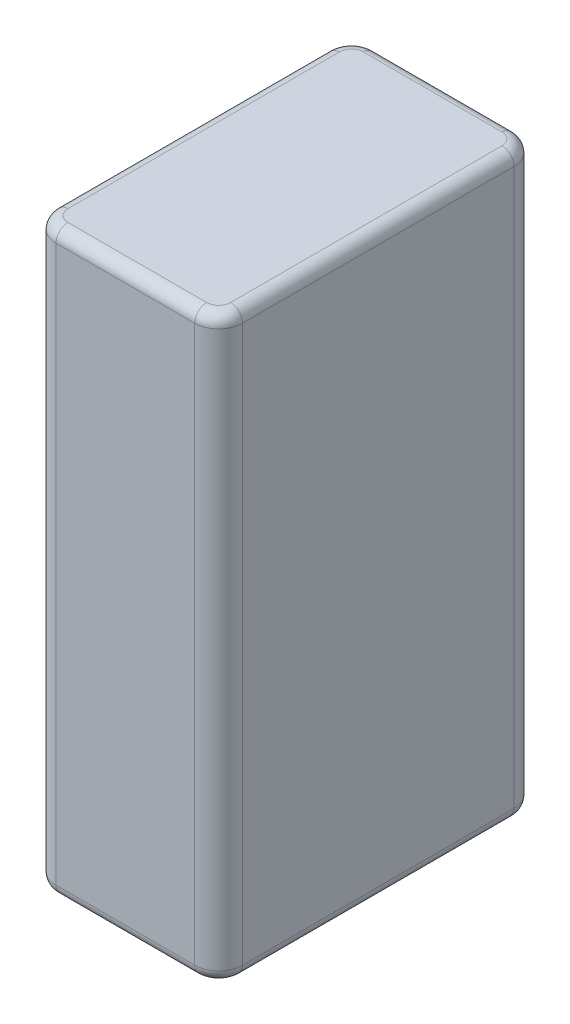
ISO-10303-21;
HEADER;
FILE_DESCRIPTION(('STEP AP214'),'2;1');
FILE_NAME('part.step','',(''),(''),'','','');
FILE_SCHEMA(('AUTOMOTIVE_DESIGN { 1 0 10303 214 1 1 1 1 }'));
ENDSEC;
DATA;
#1=APPLICATION_CONTEXT('core data for automotive mechanical design processes');
#2=APPLICATION_PROTOCOL_DEFINITION('international standard','automotive_design',2000,#1);
#3=PRODUCT_CONTEXT('',#1,'mechanical');
#4=PRODUCT('Part','Part','',(#3));
#5=PRODUCT_RELATED_PRODUCT_CATEGORY('part','',(#4));
#6=PRODUCT_DEFINITION_FORMATION('','',#4);
#7=PRODUCT_DEFINITION_CONTEXT('part definition',#1,'design');
#8=PRODUCT_DEFINITION('design','',#6,#7);
#9=PRODUCT_DEFINITION_SHAPE('','',#8);
#10=(LENGTH_UNIT() NAMED_UNIT(*) SI_UNIT(.MILLI.,.METRE.));
#11=(NAMED_UNIT(*) PLANE_ANGLE_UNIT() SI_UNIT($,.RADIAN.));
#12=(NAMED_UNIT(*) SI_UNIT($,.STERADIAN.) SOLID_ANGLE_UNIT());
#13=UNCERTAINTY_MEASURE_WITH_UNIT(LENGTH_MEASURE(1.E-05),#10,'distance_accuracy_value','');
#14=(GEOMETRIC_REPRESENTATION_CONTEXT(3) GLOBAL_UNCERTAINTY_ASSIGNED_CONTEXT((#13)) GLOBAL_UNIT_ASSIGNED_CONTEXT((#10,
#11,#12)) REPRESENTATION_CONTEXT('',''));
#15=CARTESIAN_POINT('',(0.,0.,0.));
#16=DIRECTION('',(0.,0.,1.));
#17=DIRECTION('',(1.,0.,0.));
#18=AXIS2_PLACEMENT_3D('',#15,#16,#17);
#19=CARTESIAN_POINT('',(-7.8,48.5,-13.35));
#20=DIRECTION('',(1.,0.,0.));
#21=DIRECTION('',(0.,0.,-1.));
#22=AXIS2_PLACEMENT_3D('',#19,#20,#21);
#23=PLANE('',#22);
#24=DIRECTION('',(0.,-1.,0.));
#25=VECTOR('',#24,1.);
#26=CARTESIAN_POINT('',(-7.79999999999999,48.5,11.35));
#27=LINE('',#26,#25);
#28=CARTESIAN_POINT('',(-7.79999999999999,1.,11.35));
#29=VERTEX_POINT('',#28);
#30=CARTESIAN_POINT('',(-7.79999999999999,47.5,11.35));
#31=VERTEX_POINT('',#30);
#32=EDGE_CURVE('E334',#29,#31,#27,.F.);
#33=ORIENTED_EDGE('',*,*,#32,.T.);
#34=DIRECTION('',(0.,0.,1.));
#35=VECTOR('',#34,1.);
#36=CARTESIAN_POINT('',(-7.8,47.5,-11.35));
#37=LINE('',#36,#35);
#38=CARTESIAN_POINT('',(-7.8,47.5,-11.35));
#39=VERTEX_POINT('',#38);
#40=EDGE_CURVE('E11',#31,#39,#37,.F.);
#41=ORIENTED_EDGE('',*,*,#40,.T.);
#42=DIRECTION('',(0.,-1.,0.));
#43=VECTOR('',#42,1.);
#44=CARTESIAN_POINT('',(-7.8,48.5,-11.35));
#45=LINE('',#44,#43);
#46=CARTESIAN_POINT('',(-7.8,1.,-11.35));
#47=VERTEX_POINT('',#46);
#48=EDGE_CURVE('E317',#39,#47,#45,.T.);
#49=ORIENTED_EDGE('',*,*,#48,.T.);
#50=DIRECTION('',(0.,0.,1.));
#51=VECTOR('',#50,1.);
#52=CARTESIAN_POINT('',(-7.8,1.,-13.35));
#53=LINE('',#52,#51);
#54=EDGE_CURVE('E42',#47,#29,#53,.T.);
#55=ORIENTED_EDGE('',*,*,#54,.T.);
#56=EDGE_LOOP('',(#33,#41,#49,#55));
#57=FACE_BOUND('',#56,.T.);
#58=ADVANCED_FACE('F33',(#57),#23,.F.);
#59=CARTESIAN_POINT('',(-7.79999999999999,48.5,13.35));
#60=DIRECTION('',(0.,0.,-1.));
#61=DIRECTION('',(-1.,0.,0.));
#62=AXIS2_PLACEMENT_3D('',#59,#60,#61);
#63=PLANE('',#62);
#64=DIRECTION('',(0.,-1.,0.));
#65=VECTOR('',#64,1.);
#66=CARTESIAN_POINT('',(5.8,48.5,13.35));
#67=LINE('',#66,#65);
#68=CARTESIAN_POINT('',(5.8,1.,13.35));
#69=VERTEX_POINT('',#68);
#70=CARTESIAN_POINT('',(5.8,47.5,13.35));
#71=VERTEX_POINT('',#70);
#72=EDGE_CURVE('E241',#69,#71,#67,.F.);
#73=ORIENTED_EDGE('',*,*,#72,.T.);
#74=DIRECTION('',(1.,0.,0.));
#75=VECTOR('',#74,1.);
#76=CARTESIAN_POINT('',(-5.79999999999999,47.5,13.35));
#77=LINE('',#76,#75);
#78=CARTESIAN_POINT('',(-5.79999999999999,47.5,13.35));
#79=VERTEX_POINT('',#78);
#80=EDGE_CURVE('E202',#71,#79,#77,.F.);
#81=ORIENTED_EDGE('',*,*,#80,.T.);
#82=DIRECTION('',(0.,-1.,0.));
#83=VECTOR('',#82,1.);
#84=CARTESIAN_POINT('',(-5.79999999999999,48.5,13.35));
#85=LINE('',#84,#83);
#86=CARTESIAN_POINT('',(-5.79999999999999,1.,13.35));
#87=VERTEX_POINT('',#86);
#88=EDGE_CURVE('E335',#79,#87,#85,.T.);
#89=ORIENTED_EDGE('',*,*,#88,.T.);
#90=DIRECTION('',(1.,0.,0.));
#91=VECTOR('',#90,1.);
#92=CARTESIAN_POINT('',(-7.79999999999999,1.,13.35));
#93=LINE('',#92,#91);
#94=EDGE_CURVE('E200',#87,#69,#93,.T.);
#95=ORIENTED_EDGE('',*,*,#94,.T.);
#96=EDGE_LOOP('',(#73,#81,#89,#95));
#97=FACE_BOUND('',#96,.T.);
#98=ADVANCED_FACE('F343',(#97),#63,.F.);
#99=CARTESIAN_POINT('',(7.8,48.5,-13.35));
#100=DIRECTION('',(-1.,0.,0.));
#101=DIRECTION('',(0.,0.,1.));
#102=AXIS2_PLACEMENT_3D('',#99,#100,#101);
#103=PLANE('',#102);
#104=DIRECTION('',(0.,-1.,0.));
#105=VECTOR('',#104,1.);
#106=CARTESIAN_POINT('',(7.8,48.5,-11.35));
#107=LINE('',#106,#105);
#108=CARTESIAN_POINT('',(7.8,1.,-11.35));
#109=VERTEX_POINT('',#108);
#110=CARTESIAN_POINT('',(7.8,47.5,-11.35));
#111=VERTEX_POINT('',#110);
#112=EDGE_CURVE('E169',#109,#111,#107,.F.);
#113=ORIENTED_EDGE('',*,*,#112,.T.);
#114=DIRECTION('',(0.,0.,-1.));
#115=VECTOR('',#114,1.);
#116=CARTESIAN_POINT('',(7.8,47.5,11.35));
#117=LINE('',#116,#115);
#118=CARTESIAN_POINT('',(7.8,47.5,11.35));
#119=VERTEX_POINT('',#118);
#120=EDGE_CURVE('E194',#111,#119,#117,.F.);
#121=ORIENTED_EDGE('',*,*,#120,.T.);
#122=DIRECTION('',(0.,-1.,0.));
#123=VECTOR('',#122,1.);
#124=CARTESIAN_POINT('',(7.8,48.5,11.35));
#125=LINE('',#124,#123);
#126=CARTESIAN_POINT('',(7.8,1.,11.35));
#127=VERTEX_POINT('',#126);
#128=EDGE_CURVE('E277',#119,#127,#125,.T.);
#129=ORIENTED_EDGE('',*,*,#128,.T.);
#130=DIRECTION('',(0.,0.,-1.));
#131=VECTOR('',#130,1.);
#132=CARTESIAN_POINT('',(7.8,1.,-13.35));
#133=LINE('',#132,#131);
#134=EDGE_CURVE('E192',#127,#109,#133,.T.);
#135=ORIENTED_EDGE('',*,*,#134,.T.);
#136=EDGE_LOOP('',(#113,#121,#129,#135));
#137=FACE_BOUND('',#136,.T.);
#138=ADVANCED_FACE('F282',(#137),#103,.F.);
#139=CARTESIAN_POINT('',(-7.8,48.5,-13.35));
#140=DIRECTION('',(0.,0.,1.));
#141=DIRECTION('',(1.,0.,0.));
#142=AXIS2_PLACEMENT_3D('',#139,#140,#141);
#143=PLANE('',#142);
#144=DIRECTION('',(0.,-1.,0.));
#145=VECTOR('',#144,1.);
#146=CARTESIAN_POINT('',(-5.8,48.5,-13.35));
#147=LINE('',#146,#145);
#148=CARTESIAN_POINT('',(-5.8,1.,-13.35));
#149=VERTEX_POINT('',#148);
#150=CARTESIAN_POINT('',(-5.8,47.5,-13.35));
#151=VERTEX_POINT('',#150);
#152=EDGE_CURVE('E285',#149,#151,#147,.F.);
#153=ORIENTED_EDGE('',*,*,#152,.T.);
#154=DIRECTION('',(-1.,0.,0.));
#155=VECTOR('',#154,1.);
#156=CARTESIAN_POINT('',(5.8,47.5,-13.35));
#157=LINE('',#156,#155);
#158=CARTESIAN_POINT('',(5.8,47.5,-13.35));
#159=VERTEX_POINT('',#158);
#160=EDGE_CURVE('E186',#151,#159,#157,.F.);
#161=ORIENTED_EDGE('',*,*,#160,.T.);
#162=DIRECTION('',(0.,-1.,0.));
#163=VECTOR('',#162,1.);
#164=CARTESIAN_POINT('',(5.8,48.5,-13.35));
#165=LINE('',#164,#163);
#166=CARTESIAN_POINT('',(5.8,1.,-13.35));
#167=VERTEX_POINT('',#166);
#168=EDGE_CURVE('E289',#159,#167,#165,.T.);
#169=ORIENTED_EDGE('',*,*,#168,.T.);
#170=DIRECTION('',(-1.,0.,0.));
#171=VECTOR('',#170,1.);
#172=CARTESIAN_POINT('',(-7.8,1.,-13.35));
#173=LINE('',#172,#171);
#174=EDGE_CURVE('E184',#167,#149,#173,.T.);
#175=ORIENTED_EDGE('',*,*,#174,.T.);
#176=EDGE_LOOP('',(#153,#161,#169,#175));
#177=FACE_BOUND('',#176,.T.);
#178=ADVANCED_FACE('F318',(#177),#143,.F.);
#179=CARTESIAN_POINT('',(-7.79999999999999,48.5,13.35));
#180=DIRECTION('',(0.,1.,0.));
#181=DIRECTION('',(0.,0.,1.));
#182=AXIS2_PLACEMENT_3D('',#179,#180,#181);
#183=PLANE('',#182);
#184=DIRECTION('',(-1.,0.,0.));
#185=VECTOR('',#184,1.);
#186=CARTESIAN_POINT('',(-5.8,48.5,-12.35));
#187=LINE('',#186,#185);
#188=CARTESIAN_POINT('',(5.8,48.5,-12.35));
#189=VERTEX_POINT('',#188);
#190=CARTESIAN_POINT('',(-5.8,48.5,-12.35));
#191=VERTEX_POINT('',#190);
#192=EDGE_CURVE('E173',#189,#191,#187,.T.);
#193=ORIENTED_EDGE('',*,*,#192,.T.);
#194=CARTESIAN_POINT('',(-5.8,48.5,-11.35));
#195=DIRECTION('',(0.,1.,0.));
#196=DIRECTION('',(0.,0.,1.));
#197=AXIS2_PLACEMENT_3D('',#194,#195,#196);
#198=CIRCLE('',#197,1.);
#199=CARTESIAN_POINT('',(-6.8,48.5,-11.35));
#200=VERTEX_POINT('',#199);
#201=EDGE_CURVE('E154',#191,#200,#198,.T.);
#202=ORIENTED_EDGE('',*,*,#201,.T.);
#203=DIRECTION('',(0.,0.,1.));
#204=VECTOR('',#203,1.);
#205=CARTESIAN_POINT('',(-6.79999999999999,48.5,11.35));
#206=LINE('',#205,#204);
#207=CARTESIAN_POINT('',(-6.79999999999999,48.5,11.35));
#208=VERTEX_POINT('',#207);
#209=EDGE_CURVE('E162',#200,#208,#206,.T.);
#210=ORIENTED_EDGE('',*,*,#209,.T.);
#211=CARTESIAN_POINT('',(-5.79999999999999,48.5,11.35));
#212=DIRECTION('',(0.,1.,0.));
#213=DIRECTION('',(0.,0.,1.));
#214=AXIS2_PLACEMENT_3D('',#211,#212,#213);
#215=CIRCLE('',#214,1.);
#216=CARTESIAN_POINT('',(-5.79999999999999,48.5,12.35));
#217=VERTEX_POINT('',#216);
#218=EDGE_CURVE('E168',#208,#217,#215,.T.);
#219=ORIENTED_EDGE('',*,*,#218,.T.);
#220=DIRECTION('',(1.,0.,0.));
#221=VECTOR('',#220,1.);
#222=CARTESIAN_POINT('',(5.8,48.5,12.35));
#223=LINE('',#222,#221);
#224=CARTESIAN_POINT('',(5.8,48.5,12.35));
#225=VERTEX_POINT('',#224);
#226=EDGE_CURVE('E294',#217,#225,#223,.T.);
#227=ORIENTED_EDGE('',*,*,#226,.T.);
#228=CARTESIAN_POINT('',(5.8,48.5,11.35));
#229=DIRECTION('',(0.,1.,0.));
#230=DIRECTION('',(0.,0.,1.));
#231=AXIS2_PLACEMENT_3D('',#228,#229,#230);
#232=CIRCLE('',#231,1.);
#233=CARTESIAN_POINT('',(6.8,48.5,11.35));
#234=VERTEX_POINT('',#233);
#235=EDGE_CURVE('E296',#225,#234,#232,.T.);
#236=ORIENTED_EDGE('',*,*,#235,.T.);
#237=DIRECTION('',(0.,0.,-1.));
#238=VECTOR('',#237,1.);
#239=CARTESIAN_POINT('',(6.8,48.5,-11.35));
#240=LINE('',#239,#238);
#241=CARTESIAN_POINT('',(6.8,48.5,-11.35));
#242=VERTEX_POINT('',#241);
#243=EDGE_CURVE('E298',#234,#242,#240,.T.);
#244=ORIENTED_EDGE('',*,*,#243,.T.);
#245=CARTESIAN_POINT('',(5.8,48.5,-11.35));
#246=DIRECTION('',(0.,1.,0.));
#247=DIRECTION('',(0.,0.,1.));
#248=AXIS2_PLACEMENT_3D('',#245,#246,#247);
#249=CIRCLE('',#248,1.);
#250=EDGE_CURVE('E179',#242,#189,#249,.T.);
#251=ORIENTED_EDGE('',*,*,#250,.T.);
#252=EDGE_LOOP('',(#193,#202,#210,#219,#227,#236,#244,#251));
#253=FACE_BOUND('',#252,.T.);
#254=ADVANCED_FACE('F171',(#253),#183,.T.);
#255=CARTESIAN_POINT('',(-7.79999999999999,0.,13.35));
#256=DIRECTION('',(0.,1.,0.));
#257=DIRECTION('',(0.,0.,1.));
#258=AXIS2_PLACEMENT_3D('',#255,#256,#257);
#259=PLANE('',#258);
#260=DIRECTION('',(0.,0.,1.));
#261=VECTOR('',#260,1.);
#262=CARTESIAN_POINT('',(-6.79999999999999,0.,13.35));
#263=LINE('',#262,#261);
#264=CARTESIAN_POINT('',(-6.79999999999999,0.,11.35));
#265=VERTEX_POINT('',#264);
#266=CARTESIAN_POINT('',(-6.8,0.,-11.35));
#267=VERTEX_POINT('',#266);
#268=EDGE_CURVE('E208',#265,#267,#263,.F.);
#269=ORIENTED_EDGE('',*,*,#268,.T.);
#270=CARTESIAN_POINT('',(-5.8,0.,-11.35));
#271=DIRECTION('',(0.,1.,0.));
#272=DIRECTION('',(0.,0.,1.));
#273=AXIS2_PLACEMENT_3D('',#270,#271,#272);
#274=CIRCLE('',#273,1.);
#275=CARTESIAN_POINT('',(-5.8,0.,-12.35));
#276=VERTEX_POINT('',#275);
#277=EDGE_CURVE('E221',#267,#276,#274,.F.);
#278=ORIENTED_EDGE('',*,*,#277,.T.);
#279=DIRECTION('',(-1.,0.,0.));
#280=VECTOR('',#279,1.);
#281=CARTESIAN_POINT('',(-7.79999999999999,0.,-12.35));
#282=LINE('',#281,#280);
#283=CARTESIAN_POINT('',(5.8,0.,-12.35));
#284=VERTEX_POINT('',#283);
#285=EDGE_CURVE('E57',#276,#284,#282,.F.);
#286=ORIENTED_EDGE('',*,*,#285,.T.);
#287=CARTESIAN_POINT('',(5.8,0.,-11.35));
#288=DIRECTION('',(0.,1.,0.));
#289=DIRECTION('',(0.,0.,1.));
#290=AXIS2_PLACEMENT_3D('',#287,#288,#289);
#291=CIRCLE('',#290,1.);
#292=CARTESIAN_POINT('',(6.8,0.,-11.35));
#293=VERTEX_POINT('',#292);
#294=EDGE_CURVE('E218',#284,#293,#291,.F.);
#295=ORIENTED_EDGE('',*,*,#294,.T.);
#296=DIRECTION('',(0.,0.,-1.));
#297=VECTOR('',#296,1.);
#298=CARTESIAN_POINT('',(6.8,0.,13.35));
#299=LINE('',#298,#297);
#300=CARTESIAN_POINT('',(6.8,0.,11.35));
#301=VERTEX_POINT('',#300);
#302=EDGE_CURVE('E216',#293,#301,#299,.F.);
#303=ORIENTED_EDGE('',*,*,#302,.T.);
#304=CARTESIAN_POINT('',(5.8,0.,11.35));
#305=DIRECTION('',(0.,1.,0.));
#306=DIRECTION('',(0.,0.,1.));
#307=AXIS2_PLACEMENT_3D('',#304,#305,#306);
#308=CIRCLE('',#307,1.);
#309=CARTESIAN_POINT('',(5.8,0.,12.35));
#310=VERTEX_POINT('',#309);
#311=EDGE_CURVE('E214',#301,#310,#308,.F.);
#312=ORIENTED_EDGE('',*,*,#311,.T.);
#313=DIRECTION('',(1.,0.,0.));
#314=VECTOR('',#313,1.);
#315=CARTESIAN_POINT('',(-7.79999999999999,0.,12.35));
#316=LINE('',#315,#314);
#317=CARTESIAN_POINT('',(-5.79999999999999,0.,12.35));
#318=VERTEX_POINT('',#317);
#319=EDGE_CURVE('E212',#310,#318,#316,.F.);
#320=ORIENTED_EDGE('',*,*,#319,.T.);
#321=CARTESIAN_POINT('',(-5.79999999999999,0.,11.35));
#322=DIRECTION('',(0.,1.,0.));
#323=DIRECTION('',(0.,0.,1.));
#324=AXIS2_PLACEMENT_3D('',#321,#322,#323);
#325=CIRCLE('',#324,1.);
#326=EDGE_CURVE('E210',#318,#265,#325,.F.);
#327=ORIENTED_EDGE('',*,*,#326,.T.);
#328=EDGE_LOOP('',(#269,#278,#286,#295,#303,#312,#320,#327));
#329=FACE_BOUND('',#328,.T.);
#330=ADVANCED_FACE('F323',(#329),#259,.F.);
#331=CARTESIAN_POINT('',(-5.79999999999999,48.5,11.35));
#332=DIRECTION('',(0.,-1.,0.));
#333=DIRECTION('',(0.,0.,-1.));
#334=AXIS2_PLACEMENT_3D('',#331,#332,#333);
#335=CYLINDRICAL_SURFACE('',#334,2.);
#336=ORIENTED_EDGE('',*,*,#88,.F.);
#337=CARTESIAN_POINT('',(-5.79999999999999,47.5,11.35));
#338=DIRECTION('',(0.,1.,0.));
#339=DIRECTION('',(0.,0.,1.));
#340=AXIS2_PLACEMENT_3D('',#337,#338,#339);
#341=CIRCLE('',#340,2.);
#342=EDGE_CURVE('E206',#79,#31,#341,.F.);
#343=ORIENTED_EDGE('',*,*,#342,.T.);
#344=ORIENTED_EDGE('',*,*,#32,.F.);
#345=CARTESIAN_POINT('',(-5.79999999999999,1.,11.35));
#346=DIRECTION('',(0.,1.,0.));
#347=DIRECTION('',(0.,0.,1.));
#348=AXIS2_PLACEMENT_3D('',#345,#346,#347);
#349=CIRCLE('',#348,2.);
#350=EDGE_CURVE('E204',#29,#87,#349,.T.);
#351=ORIENTED_EDGE('',*,*,#350,.T.);
#352=EDGE_LOOP('',(#336,#343,#344,#351));
#353=FACE_BOUND('',#352,.T.);
#354=ADVANCED_FACE('F358',(#353),#335,.T.);
#355=CARTESIAN_POINT('',(-5.8,48.5,-11.35));
#356=DIRECTION('',(0.,-1.,0.));
#357=DIRECTION('',(0.,0.,-1.));
#358=AXIS2_PLACEMENT_3D('',#355,#356,#357);
#359=CYLINDRICAL_SURFACE('',#358,2.);
#360=ORIENTED_EDGE('',*,*,#48,.F.);
#361=CARTESIAN_POINT('',(-5.8,47.5,-11.35));
#362=DIRECTION('',(0.,1.,0.));
#363=DIRECTION('',(0.,0.,1.));
#364=AXIS2_PLACEMENT_3D('',#361,#362,#363);
#365=CIRCLE('',#364,2.);
#366=EDGE_CURVE('E156',#39,#151,#365,.F.);
#367=ORIENTED_EDGE('',*,*,#366,.T.);
#368=ORIENTED_EDGE('',*,*,#152,.F.);
#369=CARTESIAN_POINT('',(-5.8,1.,-11.35));
#370=DIRECTION('',(0.,1.,0.));
#371=DIRECTION('',(0.,0.,1.));
#372=AXIS2_PLACEMENT_3D('',#369,#370,#371);
#373=CIRCLE('',#372,2.);
#374=EDGE_CURVE('E175',#149,#47,#373,.T.);
#375=ORIENTED_EDGE('',*,*,#374,.T.);
#376=EDGE_LOOP('',(#360,#367,#368,#375));
#377=FACE_BOUND('',#376,.T.);
#378=ADVANCED_FACE('F315',(#377),#359,.T.);
#379=CARTESIAN_POINT('',(5.8,48.5,-11.35));
#380=DIRECTION('',(0.,-1.,0.));
#381=DIRECTION('',(0.,0.,-1.));
#382=AXIS2_PLACEMENT_3D('',#379,#380,#381);
#383=CYLINDRICAL_SURFACE('',#382,2.);
#384=ORIENTED_EDGE('',*,*,#168,.F.);
#385=CARTESIAN_POINT('',(5.8,47.5,-11.35));
#386=DIRECTION('',(0.,1.,0.));
#387=DIRECTION('',(0.,0.,1.));
#388=AXIS2_PLACEMENT_3D('',#385,#386,#387);
#389=CIRCLE('',#388,2.);
#390=EDGE_CURVE('E190',#159,#111,#389,.F.);
#391=ORIENTED_EDGE('',*,*,#390,.T.);
#392=ORIENTED_EDGE('',*,*,#112,.F.);
#393=CARTESIAN_POINT('',(5.8,1.,-11.35));
#394=DIRECTION('',(0.,1.,0.));
#395=DIRECTION('',(0.,0.,1.));
#396=AXIS2_PLACEMENT_3D('',#393,#394,#395);
#397=CIRCLE('',#396,2.);
#398=EDGE_CURVE('E188',#109,#167,#397,.T.);
#399=ORIENTED_EDGE('',*,*,#398,.T.);
#400=EDGE_LOOP('',(#384,#391,#392,#399));
#401=FACE_BOUND('',#400,.T.);
#402=ADVANCED_FACE('F369',(#401),#383,.T.);
#403=CARTESIAN_POINT('',(5.8,48.5,11.35));
#404=DIRECTION('',(0.,-1.,0.));
#405=DIRECTION('',(0.,0.,-1.));
#406=AXIS2_PLACEMENT_3D('',#403,#404,#405);
#407=CYLINDRICAL_SURFACE('',#406,2.);
#408=ORIENTED_EDGE('',*,*,#128,.F.);
#409=CARTESIAN_POINT('',(5.8,47.5,11.35));
#410=DIRECTION('',(0.,1.,0.));
#411=DIRECTION('',(0.,0.,1.));
#412=AXIS2_PLACEMENT_3D('',#409,#410,#411);
#413=CIRCLE('',#412,2.);
#414=EDGE_CURVE('E198',#119,#71,#413,.F.);
#415=ORIENTED_EDGE('',*,*,#414,.T.);
#416=ORIENTED_EDGE('',*,*,#72,.F.);
#417=CARTESIAN_POINT('',(5.8,1.,11.35));
#418=DIRECTION('',(0.,1.,0.));
#419=DIRECTION('',(0.,0.,1.));
#420=AXIS2_PLACEMENT_3D('',#417,#418,#419);
#421=CIRCLE('',#420,2.);
#422=EDGE_CURVE('E196',#69,#127,#421,.T.);
#423=ORIENTED_EDGE('',*,*,#422,.T.);
#424=EDGE_LOOP('',(#408,#415,#416,#423));
#425=FACE_BOUND('',#424,.T.);
#426=ADVANCED_FACE('F276',(#425),#407,.T.);
#427=CARTESIAN_POINT('',(5.8,47.5,11.35));
#428=DIRECTION('',(0.,1.,0.));
#429=DIRECTION('',(0.,0.,1.));
#430=AXIS2_PLACEMENT_3D('',#427,#428,#429);
#431=DEGENERATE_TOROIDAL_SURFACE('',#430,1.,1.,.T.);
#432=CARTESIAN_POINT('',(5.8,47.5,12.35));
#433=DIRECTION('',(-1.,0.,0.));
#434=DIRECTION('',(0.,0.,1.));
#435=AXIS2_PLACEMENT_3D('',#432,#433,#434);
#436=CIRCLE('',#435,1.);
#437=EDGE_CURVE('E235',#71,#225,#436,.T.);
#438=ORIENTED_EDGE('',*,*,#437,.F.);
#439=ORIENTED_EDGE('',*,*,#414,.F.);
#440=CARTESIAN_POINT('',(6.8,47.5,11.35));
#441=DIRECTION('',(0.,0.,-1.));
#442=DIRECTION('',(-1.,0.,0.));
#443=AXIS2_PLACEMENT_3D('',#440,#441,#442);
#444=CIRCLE('',#443,1.);
#445=EDGE_CURVE('E238',#234,#119,#444,.T.);
#446=ORIENTED_EDGE('',*,*,#445,.F.);
#447=ORIENTED_EDGE('',*,*,#235,.F.);
#448=EDGE_LOOP('',(#438,#439,#446,#447));
#449=FACE_BOUND('',#448,.T.);
#450=ADVANCED_FACE('F348',(#449),#431,.T.);
#451=CARTESIAN_POINT('',(6.8,47.5,13.35));
#452=DIRECTION('',(0.,0.,1.));
#453=DIRECTION('',(1.,0.,0.));
#454=AXIS2_PLACEMENT_3D('',#451,#452,#453);
#455=CYLINDRICAL_SURFACE('',#454,1.);
#456=ORIENTED_EDGE('',*,*,#445,.T.);
#457=ORIENTED_EDGE('',*,*,#120,.F.);
#458=CARTESIAN_POINT('',(6.8,47.5,-11.35));
#459=DIRECTION('',(0.,0.,-1.));
#460=DIRECTION('',(-1.,0.,0.));
#461=AXIS2_PLACEMENT_3D('',#458,#459,#460);
#462=CIRCLE('',#461,1.);
#463=EDGE_CURVE('E232',#242,#111,#462,.T.);
#464=ORIENTED_EDGE('',*,*,#463,.F.);
#465=ORIENTED_EDGE('',*,*,#243,.F.);
#466=EDGE_LOOP('',(#456,#457,#464,#465));
#467=FACE_BOUND('',#466,.T.);
#468=ADVANCED_FACE('F371',(#467),#455,.T.);
#469=CARTESIAN_POINT('',(-7.79999999999999,47.5,12.35));
#470=DIRECTION('',(-1.,0.,0.));
#471=DIRECTION('',(0.,0.,1.));
#472=AXIS2_PLACEMENT_3D('',#469,#470,#471);
#473=CYLINDRICAL_SURFACE('',#472,1.);
#474=ORIENTED_EDGE('',*,*,#437,.T.);
#475=ORIENTED_EDGE('',*,*,#226,.F.);
#476=CARTESIAN_POINT('',(-5.79999999999999,47.5,12.35));
#477=DIRECTION('',(-1.,0.,0.));
#478=DIRECTION('',(0.,0.,1.));
#479=AXIS2_PLACEMENT_3D('',#476,#477,#478);
#480=CIRCLE('',#479,1.);
#481=EDGE_CURVE('E229',#79,#217,#480,.T.);
#482=ORIENTED_EDGE('',*,*,#481,.F.);
#483=ORIENTED_EDGE('',*,*,#80,.F.);
#484=EDGE_LOOP('',(#474,#475,#482,#483));
#485=FACE_BOUND('',#484,.T.);
#486=ADVANCED_FACE('F353',(#485),#473,.T.);
#487=CARTESIAN_POINT('',(5.8,47.5,-11.35));
#488=DIRECTION('',(0.,1.,0.));
#489=DIRECTION('',(0.,0.,1.));
#490=AXIS2_PLACEMENT_3D('',#487,#488,#489);
#491=DEGENERATE_TOROIDAL_SURFACE('',#490,1.,1.,.T.);
#492=ORIENTED_EDGE('',*,*,#463,.T.);
#493=ORIENTED_EDGE('',*,*,#390,.F.);
#494=CARTESIAN_POINT('',(5.8,47.5,-12.35));
#495=DIRECTION('',(-1.,0.,0.));
#496=DIRECTION('',(0.,0.,1.));
#497=AXIS2_PLACEMENT_3D('',#494,#495,#496);
#498=CIRCLE('',#497,1.);
#499=EDGE_CURVE('E226',#189,#159,#498,.T.);
#500=ORIENTED_EDGE('',*,*,#499,.F.);
#501=ORIENTED_EDGE('',*,*,#250,.F.);
#502=EDGE_LOOP('',(#492,#493,#500,#501));
#503=FACE_BOUND('',#502,.T.);
#504=ADVANCED_FACE('F305',(#503),#491,.T.);
#505=CARTESIAN_POINT('',(-5.79999999999999,47.5,11.35));
#506=DIRECTION('',(0.,1.,0.));
#507=DIRECTION('',(0.,0.,1.));
#508=AXIS2_PLACEMENT_3D('',#505,#506,#507);
#509=DEGENERATE_TOROIDAL_SURFACE('',#508,1.,1.,.T.);
#510=ORIENTED_EDGE('',*,*,#481,.T.);
#511=ORIENTED_EDGE('',*,*,#218,.F.);
#512=CARTESIAN_POINT('',(-6.79999999999999,47.5,11.35));
#513=DIRECTION('',(0.,0.,-1.));
#514=DIRECTION('',(-1.,0.,0.));
#515=AXIS2_PLACEMENT_3D('',#512,#513,#514);
#516=CIRCLE('',#515,1.);
#517=EDGE_CURVE('E165',#31,#208,#516,.T.);
#518=ORIENTED_EDGE('',*,*,#517,.F.);
#519=ORIENTED_EDGE('',*,*,#342,.F.);
#520=EDGE_LOOP('',(#510,#511,#518,#519));
#521=FACE_BOUND('',#520,.T.);
#522=ADVANCED_FACE('F356',(#521),#509,.T.);
#523=CARTESIAN_POINT('',(-7.79999999999999,47.5,-12.35));
#524=DIRECTION('',(1.,0.,0.));
#525=DIRECTION('',(0.,0.,-1.));
#526=AXIS2_PLACEMENT_3D('',#523,#524,#525);
#527=CYLINDRICAL_SURFACE('',#526,1.);
#528=ORIENTED_EDGE('',*,*,#499,.T.);
#529=ORIENTED_EDGE('',*,*,#160,.F.);
#530=CARTESIAN_POINT('',(-5.8,47.5,-12.35));
#531=DIRECTION('',(-1.,0.,0.));
#532=DIRECTION('',(0.,0.,1.));
#533=AXIS2_PLACEMENT_3D('',#530,#531,#532);
#534=CIRCLE('',#533,1.);
#535=EDGE_CURVE('E159',#191,#151,#534,.T.);
#536=ORIENTED_EDGE('',*,*,#535,.F.);
#537=ORIENTED_EDGE('',*,*,#192,.F.);
#538=EDGE_LOOP('',(#528,#529,#536,#537));
#539=FACE_BOUND('',#538,.T.);
#540=ADVANCED_FACE('F308',(#539),#527,.T.);
#541=CARTESIAN_POINT('',(-6.79999999999999,47.5,13.35));
#542=DIRECTION('',(0.,0.,-1.));
#543=DIRECTION('',(-1.,0.,0.));
#544=AXIS2_PLACEMENT_3D('',#541,#542,#543);
#545=CYLINDRICAL_SURFACE('',#544,1.);
#546=ORIENTED_EDGE('',*,*,#517,.T.);
#547=ORIENTED_EDGE('',*,*,#209,.F.);
#548=CARTESIAN_POINT('',(-6.8,47.5,-11.35));
#549=DIRECTION('',(0.,0.,-1.));
#550=DIRECTION('',(-1.,0.,0.));
#551=AXIS2_PLACEMENT_3D('',#548,#549,#550);
#552=CIRCLE('',#551,1.);
#553=EDGE_CURVE('E150',#39,#200,#552,.T.);
#554=ORIENTED_EDGE('',*,*,#553,.F.);
#555=ORIENTED_EDGE('',*,*,#40,.F.);
#556=EDGE_LOOP('',(#546,#547,#554,#555));
#557=FACE_BOUND('',#556,.T.);
#558=ADVANCED_FACE('F163',(#557),#545,.T.);
#559=CARTESIAN_POINT('',(-5.8,47.5,-11.35));
#560=DIRECTION('',(0.,1.,0.));
#561=DIRECTION('',(0.,0.,1.));
#562=AXIS2_PLACEMENT_3D('',#559,#560,#561);
#563=DEGENERATE_TOROIDAL_SURFACE('',#562,1.,1.,.T.);
#564=ORIENTED_EDGE('',*,*,#535,.T.);
#565=ORIENTED_EDGE('',*,*,#366,.F.);
#566=ORIENTED_EDGE('',*,*,#553,.T.);
#567=ORIENTED_EDGE('',*,*,#201,.F.);
#568=EDGE_LOOP('',(#564,#565,#566,#567));
#569=FACE_BOUND('',#568,.T.);
#570=ADVANCED_FACE('F152',(#569),#563,.T.);
#571=CARTESIAN_POINT('',(5.8,1.,11.35));
#572=DIRECTION('',(0.,1.,0.));
#573=DIRECTION('',(0.,0.,1.));
#574=AXIS2_PLACEMENT_3D('',#571,#572,#573);
#575=DEGENERATE_TOROIDAL_SURFACE('',#574,1.,1.,.T.);
#576=CARTESIAN_POINT('',(6.8,1.,11.35));
#577=DIRECTION('',(0.,0.,-1.));
#578=DIRECTION('',(-1.,0.,0.));
#579=AXIS2_PLACEMENT_3D('',#576,#577,#578);
#580=CIRCLE('',#579,1.);
#581=EDGE_CURVE('E256',#127,#301,#580,.T.);
#582=ORIENTED_EDGE('',*,*,#581,.F.);
#583=ORIENTED_EDGE('',*,*,#422,.F.);
#584=CARTESIAN_POINT('',(5.8,1.,12.35));
#585=DIRECTION('',(-1.,0.,0.));
#586=DIRECTION('',(0.,0.,1.));
#587=AXIS2_PLACEMENT_3D('',#584,#585,#586);
#588=CIRCLE('',#587,1.);
#589=EDGE_CURVE('E37',#310,#69,#588,.T.);
#590=ORIENTED_EDGE('',*,*,#589,.F.);
#591=ORIENTED_EDGE('',*,*,#311,.F.);
#592=EDGE_LOOP('',(#582,#583,#590,#591));
#593=FACE_BOUND('',#592,.T.);
#594=ADVANCED_FACE('F35',(#593),#575,.T.);
#595=CARTESIAN_POINT('',(-7.79999999999999,1.,12.35));
#596=DIRECTION('',(1.,0.,0.));
#597=DIRECTION('',(0.,0.,-1.));
#598=AXIS2_PLACEMENT_3D('',#595,#596,#597);
#599=CYLINDRICAL_SURFACE('',#598,1.);
#600=ORIENTED_EDGE('',*,*,#589,.T.);
#601=ORIENTED_EDGE('',*,*,#94,.F.);
#602=CARTESIAN_POINT('',(-5.79999999999999,1.,12.35));
#603=DIRECTION('',(-1.,0.,0.));
#604=DIRECTION('',(0.,0.,1.));
#605=AXIS2_PLACEMENT_3D('',#602,#603,#604);
#606=CIRCLE('',#605,1.);
#607=EDGE_CURVE('E254',#318,#87,#606,.T.);
#608=ORIENTED_EDGE('',*,*,#607,.F.);
#609=ORIENTED_EDGE('',*,*,#319,.F.);
#610=EDGE_LOOP('',(#600,#601,#608,#609));
#611=FACE_BOUND('',#610,.T.);
#612=ADVANCED_FACE('F267',(#611),#599,.T.);
#613=CARTESIAN_POINT('',(6.8,1.,-13.35));
#614=DIRECTION('',(0.,0.,-1.));
#615=DIRECTION('',(-1.,0.,0.));
#616=AXIS2_PLACEMENT_3D('',#613,#614,#615);
#617=CYLINDRICAL_SURFACE('',#616,1.);
#618=ORIENTED_EDGE('',*,*,#581,.T.);
#619=ORIENTED_EDGE('',*,*,#302,.F.);
#620=CARTESIAN_POINT('',(6.8,1.,-11.35));
#621=DIRECTION('',(0.,0.,-1.));
#622=DIRECTION('',(-1.,0.,0.));
#623=AXIS2_PLACEMENT_3D('',#620,#621,#622);
#624=CIRCLE('',#623,1.);
#625=EDGE_CURVE('E251',#109,#293,#624,.T.);
#626=ORIENTED_EDGE('',*,*,#625,.F.);
#627=ORIENTED_EDGE('',*,*,#134,.F.);
#628=EDGE_LOOP('',(#618,#619,#626,#627));
#629=FACE_BOUND('',#628,.T.);
#630=ADVANCED_FACE('F364',(#629),#617,.T.);
#631=CARTESIAN_POINT('',(-5.79999999999999,1.,11.35));
#632=DIRECTION('',(0.,1.,0.));
#633=DIRECTION('',(0.,0.,1.));
#634=AXIS2_PLACEMENT_3D('',#631,#632,#633);
#635=DEGENERATE_TOROIDAL_SURFACE('',#634,1.,1.,.T.);
#636=ORIENTED_EDGE('',*,*,#607,.T.);
#637=ORIENTED_EDGE('',*,*,#350,.F.);
#638=CARTESIAN_POINT('',(-6.79999999999999,1.,11.35));
#639=DIRECTION('',(0.,0.,-1.));
#640=DIRECTION('',(-1.,0.,0.));
#641=AXIS2_PLACEMENT_3D('',#638,#639,#640);
#642=CIRCLE('',#641,1.);
#643=EDGE_CURVE('E248',#265,#29,#642,.T.);
#644=ORIENTED_EDGE('',*,*,#643,.F.);
#645=ORIENTED_EDGE('',*,*,#326,.F.);
#646=EDGE_LOOP('',(#636,#637,#644,#645));
#647=FACE_BOUND('',#646,.T.);
#648=ADVANCED_FACE('F361',(#647),#635,.T.);
#649=CARTESIAN_POINT('',(5.8,1.,-11.35));
#650=DIRECTION('',(0.,1.,0.));
#651=DIRECTION('',(0.,0.,1.));
#652=AXIS2_PLACEMENT_3D('',#649,#650,#651);
#653=DEGENERATE_TOROIDAL_SURFACE('',#652,1.,1.,.T.);
#654=ORIENTED_EDGE('',*,*,#625,.T.);
#655=ORIENTED_EDGE('',*,*,#294,.F.);
#656=CARTESIAN_POINT('',(5.8,1.,-12.35));
#657=DIRECTION('',(-1.,0.,0.));
#658=DIRECTION('',(0.,0.,1.));
#659=AXIS2_PLACEMENT_3D('',#656,#657,#658);
#660=CIRCLE('',#659,1.);
#661=EDGE_CURVE('E245',#167,#284,#660,.T.);
#662=ORIENTED_EDGE('',*,*,#661,.F.);
#663=ORIENTED_EDGE('',*,*,#398,.F.);
#664=EDGE_LOOP('',(#654,#655,#662,#663));
#665=FACE_BOUND('',#664,.T.);
#666=ADVANCED_FACE('F367',(#665),#653,.T.);
#667=CARTESIAN_POINT('',(-6.8,1.,-13.35));
#668=DIRECTION('',(0.,0.,1.));
#669=DIRECTION('',(1.,0.,0.));
#670=AXIS2_PLACEMENT_3D('',#667,#668,#669);
#671=CYLINDRICAL_SURFACE('',#670,1.);
#672=ORIENTED_EDGE('',*,*,#643,.T.);
#673=ORIENTED_EDGE('',*,*,#54,.F.);
#674=CARTESIAN_POINT('',(-6.8,1.,-11.35));
#675=DIRECTION('',(0.,0.,-1.));
#676=DIRECTION('',(-1.,0.,0.));
#677=AXIS2_PLACEMENT_3D('',#674,#675,#676);
#678=CIRCLE('',#677,1.);
#679=EDGE_CURVE('E243',#267,#47,#678,.T.);
#680=ORIENTED_EDGE('',*,*,#679,.F.);
#681=ORIENTED_EDGE('',*,*,#268,.F.);
#682=EDGE_LOOP('',(#672,#673,#680,#681));
#683=FACE_BOUND('',#682,.T.);
#684=ADVANCED_FACE('F329',(#683),#671,.T.);
#685=CARTESIAN_POINT('',(-7.8,1.,-12.35));
#686=DIRECTION('',(-1.,0.,0.));
#687=DIRECTION('',(0.,0.,1.));
#688=AXIS2_PLACEMENT_3D('',#685,#686,#687);
#689=CYLINDRICAL_SURFACE('',#688,1.);
#690=ORIENTED_EDGE('',*,*,#661,.T.);
#691=ORIENTED_EDGE('',*,*,#285,.F.);
#692=CARTESIAN_POINT('',(-5.8,1.,-12.35));
#693=DIRECTION('',(-1.,0.,0.));
#694=DIRECTION('',(0.,0.,1.));
#695=AXIS2_PLACEMENT_3D('',#692,#693,#694);
#696=CIRCLE('',#695,1.);
#697=EDGE_CURVE('E50',#149,#276,#696,.T.);
#698=ORIENTED_EDGE('',*,*,#697,.F.);
#699=ORIENTED_EDGE('',*,*,#174,.F.);
#700=EDGE_LOOP('',(#690,#691,#698,#699));
#701=FACE_BOUND('',#700,.T.);
#702=ADVANCED_FACE('F322',(#701),#689,.T.);
#703=CARTESIAN_POINT('',(-5.8,1.,-11.35));
#704=DIRECTION('',(0.,1.,0.));
#705=DIRECTION('',(0.,0.,1.));
#706=AXIS2_PLACEMENT_3D('',#703,#704,#705);
#707=DEGENERATE_TOROIDAL_SURFACE('',#706,1.,1.,.T.);
#708=ORIENTED_EDGE('',*,*,#679,.T.);
#709=ORIENTED_EDGE('',*,*,#374,.F.);
#710=ORIENTED_EDGE('',*,*,#697,.T.);
#711=ORIENTED_EDGE('',*,*,#277,.F.);
#712=EDGE_LOOP('',(#708,#709,#710,#711));
#713=FACE_BOUND('',#712,.T.);
#714=ADVANCED_FACE('F326',(#713),#707,.T.);
#715=CLOSED_SHELL('',(#58,#98,#138,#178,#254,#330,#354,#378,#402,#426,#450,#468,#486,#504,#522,
#540,#558,#570,#594,#612,#630,#648,#666,#684,#702,#714));
#716=MANIFOLD_SOLID_BREP('B2',#715);
#717=ADVANCED_BREP_SHAPE_REPRESENTATION('',(#18,#716),#14);
#718=SHAPE_DEFINITION_REPRESENTATION(#9,#717);
ENDSEC;
END-ISO-10303-21;
